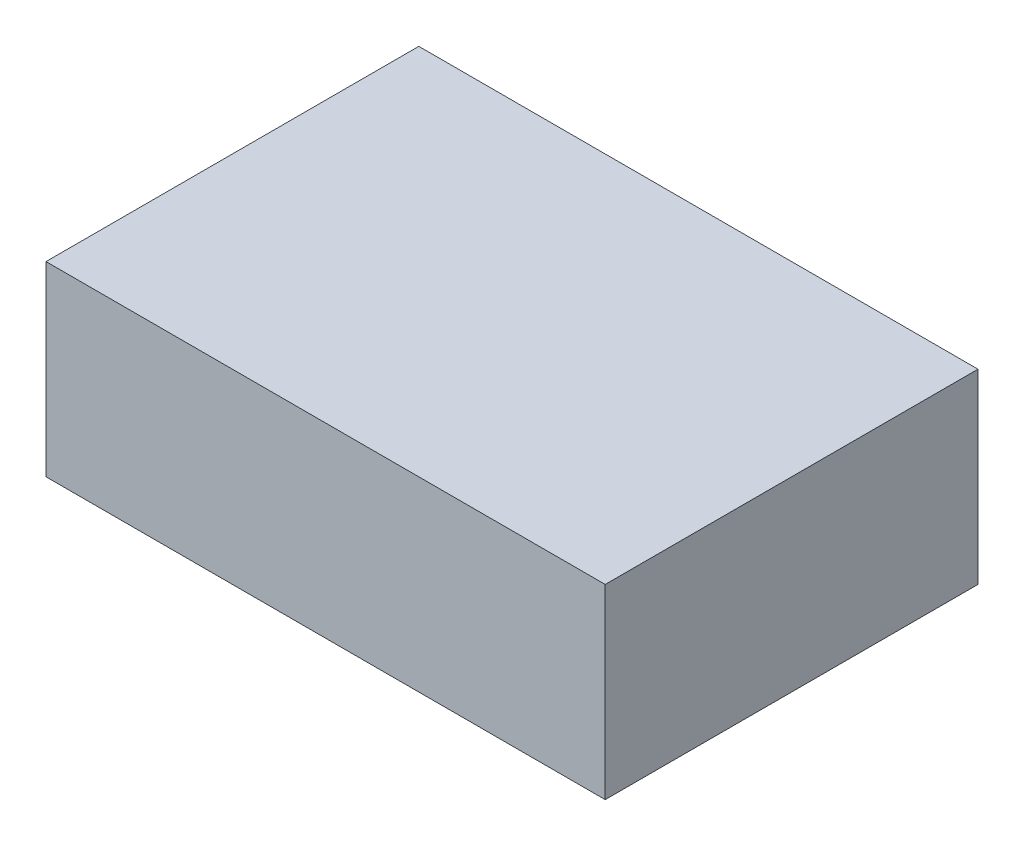
ISO-10303-21;
HEADER;
FILE_DESCRIPTION(('STEP AP214'),'2;1');
FILE_NAME('part.step','',(''),(''),'','','');
FILE_SCHEMA(('AUTOMOTIVE_DESIGN { 1 0 10303 214 1 1 1 1 }'));
ENDSEC;
DATA;
#1=APPLICATION_CONTEXT('core data for automotive mechanical design processes');
#2=APPLICATION_PROTOCOL_DEFINITION('international standard','automotive_design',2000,#1);
#3=PRODUCT_CONTEXT('',#1,'mechanical');
#4=PRODUCT('Part','Part','',(#3));
#5=PRODUCT_RELATED_PRODUCT_CATEGORY('part','',(#4));
#6=PRODUCT_DEFINITION_FORMATION('','',#4);
#7=PRODUCT_DEFINITION_CONTEXT('part definition',#1,'design');
#8=PRODUCT_DEFINITION('design','',#6,#7);
#9=PRODUCT_DEFINITION_SHAPE('','',#8);
#10=(LENGTH_UNIT() NAMED_UNIT(*) SI_UNIT(.MILLI.,.METRE.));
#11=(NAMED_UNIT(*) PLANE_ANGLE_UNIT() SI_UNIT($,.RADIAN.));
#12=(NAMED_UNIT(*) SI_UNIT($,.STERADIAN.) SOLID_ANGLE_UNIT());
#13=UNCERTAINTY_MEASURE_WITH_UNIT(LENGTH_MEASURE(1.E-05),#10,'distance_accuracy_value','');
#14=(GEOMETRIC_REPRESENTATION_CONTEXT(3) GLOBAL_UNCERTAINTY_ASSIGNED_CONTEXT((#13)) GLOBAL_UNIT_ASSIGNED_CONTEXT((#10,
#11,#12)) REPRESENTATION_CONTEXT('',''));
#15=CARTESIAN_POINT('',(0.,0.,0.));
#16=DIRECTION('',(0.,0.,1.));
#17=DIRECTION('',(1.,0.,0.));
#18=AXIS2_PLACEMENT_3D('',#15,#16,#17);
#19=CARTESIAN_POINT('',(75.,50.,50.));
#20=DIRECTION('',(0.,0.,1.));
#21=DIRECTION('',(1.,0.,0.));
#22=AXIS2_PLACEMENT_3D('',#19,#20,#21);
#23=PLANE('',#22);
#24=DIRECTION('',(-1.,0.,0.));
#25=VECTOR('',#24,1.);
#26=CARTESIAN_POINT('',(75.,0.,50.));
#27=LINE('',#26,#25);
#28=CARTESIAN_POINT('',(75.,0.,50.));
#29=VERTEX_POINT('',#28);
#30=CARTESIAN_POINT('',(-75.,0.,50.));
#31=VERTEX_POINT('',#30);
#32=EDGE_CURVE('E110',#29,#31,#27,.T.);
#33=ORIENTED_EDGE('',*,*,#32,.F.);
#34=DIRECTION('',(0.,-1.,0.));
#35=VECTOR('',#34,1.);
#36=CARTESIAN_POINT('',(75.,50.,50.));
#37=LINE('',#36,#35);
#38=CARTESIAN_POINT('',(75.,50.,50.));
#39=VERTEX_POINT('',#38);
#40=EDGE_CURVE('E11',#39,#29,#37,.T.);
#41=ORIENTED_EDGE('',*,*,#40,.F.);
#42=DIRECTION('',(-1.,0.,0.));
#43=VECTOR('',#42,1.);
#44=CARTESIAN_POINT('',(75.,50.,50.));
#45=LINE('',#44,#43);
#46=CARTESIAN_POINT('',(-75.,50.,50.));
#47=VERTEX_POINT('',#46);
#48=EDGE_CURVE('E103',#39,#47,#45,.T.);
#49=ORIENTED_EDGE('',*,*,#48,.T.);
#50=DIRECTION('',(0.,-1.,0.));
#51=VECTOR('',#50,1.);
#52=CARTESIAN_POINT('',(-75.,50.,50.));
#53=LINE('',#52,#51);
#54=EDGE_CURVE('E42',#47,#31,#53,.T.);
#55=ORIENTED_EDGE('',*,*,#54,.T.);
#56=EDGE_LOOP('',(#33,#41,#49,#55));
#57=FACE_BOUND('',#56,.T.);
#58=ADVANCED_FACE('F39',(#57),#23,.T.);
#59=CARTESIAN_POINT('',(75.,50.,50.));
#60=DIRECTION('',(-1.,0.,0.));
#61=DIRECTION('',(0.,0.,1.));
#62=AXIS2_PLACEMENT_3D('',#59,#60,#61);
#63=PLANE('',#62);
#64=DIRECTION('',(0.,0.,-1.));
#65=VECTOR('',#64,1.);
#66=CARTESIAN_POINT('',(75.,0.,50.));
#67=LINE('',#66,#65);
#68=CARTESIAN_POINT('',(75.,0.,-50.));
#69=VERTEX_POINT('',#68);
#70=EDGE_CURVE('E73',#29,#69,#67,.T.);
#71=ORIENTED_EDGE('',*,*,#70,.T.);
#72=DIRECTION('',(0.,-1.,0.));
#73=VECTOR('',#72,1.);
#74=CARTESIAN_POINT('',(75.,50.,-50.));
#75=LINE('',#74,#73);
#76=CARTESIAN_POINT('',(75.,50.,-50.));
#77=VERTEX_POINT('',#76);
#78=EDGE_CURVE('E49',#77,#69,#75,.T.);
#79=ORIENTED_EDGE('',*,*,#78,.F.);
#80=DIRECTION('',(0.,0.,-1.));
#81=VECTOR('',#80,1.);
#82=CARTESIAN_POINT('',(75.,50.,50.));
#83=LINE('',#82,#81);
#84=EDGE_CURVE('E90',#39,#77,#83,.T.);
#85=ORIENTED_EDGE('',*,*,#84,.F.);
#86=ORIENTED_EDGE('',*,*,#40,.T.);
#87=EDGE_LOOP('',(#71,#79,#85,#86));
#88=FACE_BOUND('',#87,.T.);
#89=ADVANCED_FACE('F126',(#88),#63,.F.);
#90=CARTESIAN_POINT('',(75.,50.,-50.));
#91=DIRECTION('',(0.,0.,1.));
#92=DIRECTION('',(1.,0.,0.));
#93=AXIS2_PLACEMENT_3D('',#90,#91,#92);
#94=PLANE('',#93);
#95=DIRECTION('',(-1.,0.,0.));
#96=VECTOR('',#95,1.);
#97=CARTESIAN_POINT('',(75.,0.,-50.));
#98=LINE('',#97,#96);
#99=CARTESIAN_POINT('',(-75.,0.,-50.));
#100=VERTEX_POINT('',#99);
#101=EDGE_CURVE('E98',#69,#100,#98,.T.);
#102=ORIENTED_EDGE('',*,*,#101,.T.);
#103=DIRECTION('',(0.,-1.,0.));
#104=VECTOR('',#103,1.);
#105=CARTESIAN_POINT('',(-75.,50.,-50.));
#106=LINE('',#105,#104);
#107=CARTESIAN_POINT('',(-75.,50.,-50.));
#108=VERTEX_POINT('',#107);
#109=EDGE_CURVE('E95',#108,#100,#106,.T.);
#110=ORIENTED_EDGE('',*,*,#109,.F.);
#111=DIRECTION('',(-1.,0.,0.));
#112=VECTOR('',#111,1.);
#113=CARTESIAN_POINT('',(75.,50.,-50.));
#114=LINE('',#113,#112);
#115=EDGE_CURVE('E85',#77,#108,#114,.T.);
#116=ORIENTED_EDGE('',*,*,#115,.F.);
#117=ORIENTED_EDGE('',*,*,#78,.T.);
#118=EDGE_LOOP('',(#102,#110,#116,#117));
#119=FACE_BOUND('',#118,.T.);
#120=ADVANCED_FACE('F96',(#119),#94,.F.);
#121=CARTESIAN_POINT('',(-75.,50.,50.));
#122=DIRECTION('',(-1.,0.,0.));
#123=DIRECTION('',(0.,0.,1.));
#124=AXIS2_PLACEMENT_3D('',#121,#122,#123);
#125=PLANE('',#124);
#126=DIRECTION('',(0.,0.,-1.));
#127=VECTOR('',#126,1.);
#128=CARTESIAN_POINT('',(-75.,0.,50.));
#129=LINE('',#128,#127);
#130=EDGE_CURVE('E114',#31,#100,#129,.T.);
#131=ORIENTED_EDGE('',*,*,#130,.F.);
#132=ORIENTED_EDGE('',*,*,#54,.F.);
#133=DIRECTION('',(0.,0.,-1.));
#134=VECTOR('',#133,1.);
#135=CARTESIAN_POINT('',(-75.,50.,50.));
#136=LINE('',#135,#134);
#137=EDGE_CURVE('E89',#47,#108,#136,.T.);
#138=ORIENTED_EDGE('',*,*,#137,.T.);
#139=ORIENTED_EDGE('',*,*,#109,.T.);
#140=EDGE_LOOP('',(#131,#132,#138,#139));
#141=FACE_BOUND('',#140,.T.);
#142=ADVANCED_FACE('F101',(#141),#125,.T.);
#143=CARTESIAN_POINT('',(0.,50.,0.));
#144=DIRECTION('',(0.,-1.,0.));
#145=DIRECTION('',(0.,0.,-1.));
#146=AXIS2_PLACEMENT_3D('',#143,#144,#145);
#147=PLANE('',#146);
#148=ORIENTED_EDGE('',*,*,#48,.F.);
#149=ORIENTED_EDGE('',*,*,#84,.T.);
#150=ORIENTED_EDGE('',*,*,#115,.T.);
#151=ORIENTED_EDGE('',*,*,#137,.F.);
#152=EDGE_LOOP('',(#148,#149,#150,#151));
#153=FACE_BOUND('',#152,.T.);
#154=ADVANCED_FACE('F88',(#153),#147,.F.);
#155=CARTESIAN_POINT('',(0.,0.,0.));
#156=DIRECTION('',(0.,-1.,0.));
#157=DIRECTION('',(0.,0.,-1.));
#158=AXIS2_PLACEMENT_3D('',#155,#156,#157);
#159=PLANE('',#158);
#160=ORIENTED_EDGE('',*,*,#32,.T.);
#161=ORIENTED_EDGE('',*,*,#130,.T.);
#162=ORIENTED_EDGE('',*,*,#101,.F.);
#163=ORIENTED_EDGE('',*,*,#70,.F.);
#164=EDGE_LOOP('',(#160,#161,#162,#163));
#165=FACE_BOUND('',#164,.T.);
#166=ADVANCED_FACE('F123',(#165),#159,.T.);
#167=CLOSED_SHELL('',(#58,#89,#120,#142,#154,#166));
#168=MANIFOLD_SOLID_BREP('B2',#167);
#169=ADVANCED_BREP_SHAPE_REPRESENTATION('',(#18,#168),#14);
#170=SHAPE_DEFINITION_REPRESENTATION(#9,#169);
ENDSEC;
END-ISO-10303-21;
